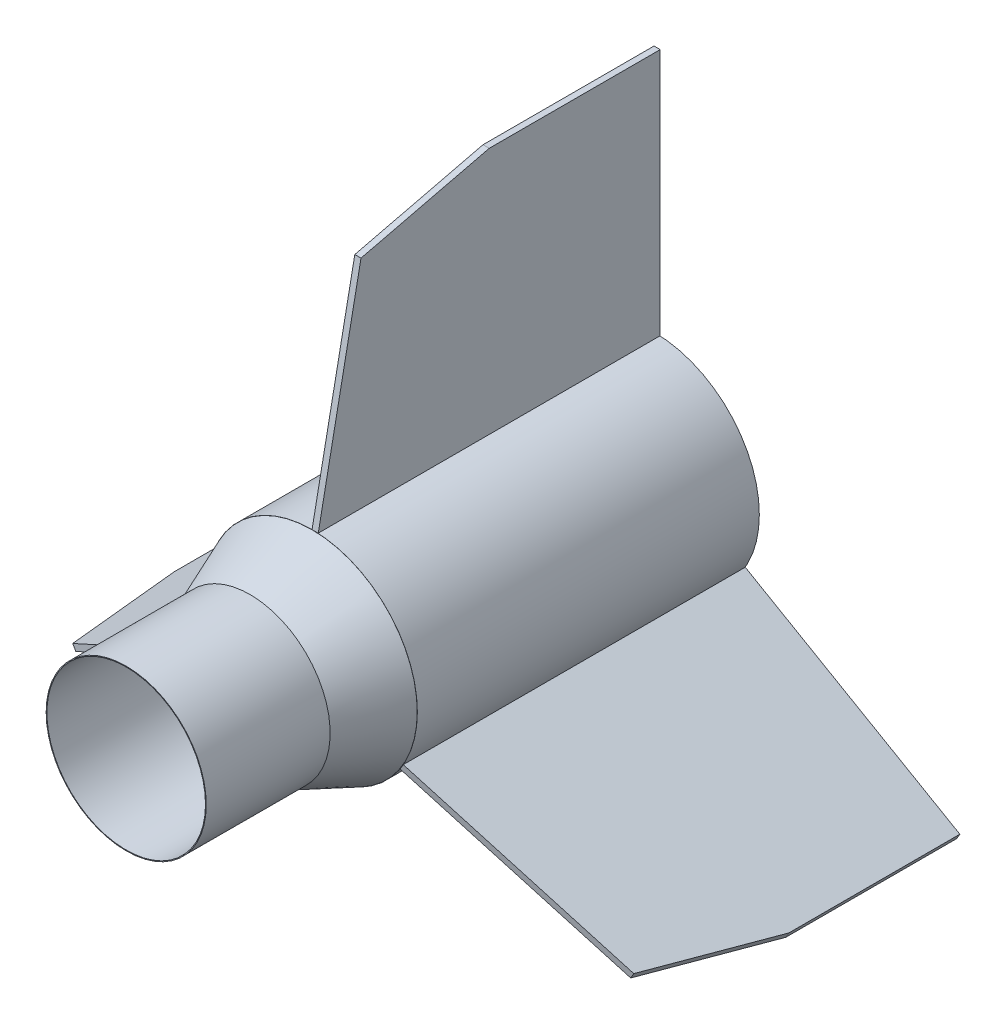
ISO-10303-21;
HEADER;
FILE_DESCRIPTION(('STEP AP214'),'2;1');
FILE_NAME('part.step','',(''),(''),'','','');
FILE_SCHEMA(('AUTOMOTIVE_DESIGN { 1 0 10303 214 1 1 1 1 }'));
ENDSEC;
DATA;
#1=APPLICATION_CONTEXT('core data for automotive mechanical design processes');
#2=APPLICATION_PROTOCOL_DEFINITION('international standard','automotive_design',2000,#1);
#3=PRODUCT_CONTEXT('',#1,'mechanical');
#4=PRODUCT('Part','Part','',(#3));
#5=PRODUCT_RELATED_PRODUCT_CATEGORY('part','',(#4));
#6=PRODUCT_DEFINITION_FORMATION('','',#4);
#7=PRODUCT_DEFINITION_CONTEXT('part definition',#1,'design');
#8=PRODUCT_DEFINITION('design','',#6,#7);
#9=PRODUCT_DEFINITION_SHAPE('','',#8);
#10=(LENGTH_UNIT() NAMED_UNIT(*) SI_UNIT(.MILLI.,.METRE.));
#11=(NAMED_UNIT(*) PLANE_ANGLE_UNIT() SI_UNIT($,.RADIAN.));
#12=(NAMED_UNIT(*) SI_UNIT($,.STERADIAN.) SOLID_ANGLE_UNIT());
#13=UNCERTAINTY_MEASURE_WITH_UNIT(LENGTH_MEASURE(1.E-05),#10,'distance_accuracy_value','');
#14=(GEOMETRIC_REPRESENTATION_CONTEXT(3) GLOBAL_UNCERTAINTY_ASSIGNED_CONTEXT((#13)) GLOBAL_UNIT_ASSIGNED_CONTEXT((#10,
#11,#12)) REPRESENTATION_CONTEXT('',''));
#15=CARTESIAN_POINT('',(0.,0.,0.));
#16=DIRECTION('',(0.,0.,1.));
#17=DIRECTION('',(1.,0.,0.));
#18=AXIS2_PLACEMENT_3D('',#15,#16,#17);
#19=CARTESIAN_POINT('',(18.0624884677061,-11.8948522628061,0.));
#20=DIRECTION('',(0.866025403784443,-0.499999999999992,0.));
#21=DIRECTION('',(0.,0.,1.));
#22=AXIS2_PLACEMENT_3D('',#19,#20,#21);
#23=PLANE('',#22);
#24=DIRECTION('',(0.,0.,-1.));
#25=VECTOR('',#24,1.);
#26=CARTESIAN_POINT('',(18.6974884677061,-10.7949999999998,0.));
#27=LINE('',#26,#25);
#28=CARTESIAN_POINT('',(18.6974884677061,-10.7949999999998,70.1));
#29=VERTEX_POINT('',#28);
#30=CARTESIAN_POINT('',(18.6974884677061,-10.7949999999998,0.));
#31=VERTEX_POINT('',#30);
#32=EDGE_CURVE('E121',#29,#31,#27,.T.);
#33=ORIENTED_EDGE('',*,*,#32,.T.);
#34=DIRECTION('',(0.499999999999992,0.866025403784443,0.));
#35=VECTOR('',#34,1.);
#36=CARTESIAN_POINT('',(18.0624884677061,-11.8948522628061,0.));
#37=LINE('',#36,#35);
#38=CARTESIAN_POINT('',(18.0624884677061,-11.8948522628061,0.));
#39=VERTEX_POINT('',#38);
#40=EDGE_CURVE('E12',#39,#31,#37,.T.);
#41=ORIENTED_EDGE('',*,*,#40,.F.);
#42=DIRECTION('',(0.,0.,-1.));
#43=VECTOR('',#42,1.);
#44=CARTESIAN_POINT('',(18.0624884677061,-11.8948522628061,0.));
#45=LINE('',#44,#43);
#46=CARTESIAN_POINT('',(18.0624884677061,-11.8948522628061,70.1));
#47=VERTEX_POINT('',#46);
#48=EDGE_CURVE('E129',#47,#39,#45,.T.);
#49=ORIENTED_EDGE('',*,*,#48,.F.);
#50=DIRECTION('',(0.499999999999992,0.866025403784443,0.));
#51=VECTOR('',#50,1.);
#52=CARTESIAN_POINT('',(18.0624884677061,-11.8948522628061,70.1));
#53=LINE('',#52,#51);
#54=EDGE_CURVE('E117',#47,#29,#53,.T.);
#55=ORIENTED_EDGE('',*,*,#54,.T.);
#56=EDGE_LOOP('',(#33,#41,#49,#55));
#57=FACE_BOUND('',#56,.T.);
#58=ADVANCED_FACE('F47',(#57),#23,.F.);
#59=CARTESIAN_POINT('',(62.0565789799559,-37.2948522628057,0.));
#60=DIRECTION('',(0.,0.,1.));
#61=DIRECTION('',(-0.499999999999992,-0.866025403784443,0.));
#62=AXIS2_PLACEMENT_3D('',#59,#60,#61);
#63=PLANE('',#62);
#64=DIRECTION('',(0.866025403784443,-0.499999999999992,0.));
#65=VECTOR('',#64,1.);
#66=CARTESIAN_POINT('',(62.6915789799558,-36.1949999999994,0.));
#67=LINE('',#66,#65);
#68=CARTESIAN_POINT('',(62.6915789799558,-36.1949999999994,0.));
#69=VERTEX_POINT('',#68);
#70=EDGE_CURVE('E124',#31,#69,#67,.T.);
#71=ORIENTED_EDGE('',*,*,#70,.T.);
#72=DIRECTION('',(0.499999999999992,0.866025403784443,0.));
#73=VECTOR('',#72,1.);
#74=CARTESIAN_POINT('',(62.0565789799559,-37.2948522628057,0.));
#75=LINE('',#74,#73);
#76=CARTESIAN_POINT('',(62.0565789799559,-37.2948522628057,0.));
#77=VERTEX_POINT('',#76);
#78=EDGE_CURVE('E55',#77,#69,#75,.T.);
#79=ORIENTED_EDGE('',*,*,#78,.F.);
#80=DIRECTION('',(0.866025403784443,-0.499999999999992,0.));
#81=VECTOR('',#80,1.);
#82=CARTESIAN_POINT('',(40.059533723831,-24.5948522628059,0.));
#83=LINE('',#82,#81);
#84=EDGE_CURVE('E97',#39,#77,#83,.T.);
#85=ORIENTED_EDGE('',*,*,#84,.F.);
#86=ORIENTED_EDGE('',*,*,#40,.T.);
#87=EDGE_LOOP('',(#71,#79,#85,#86));
#88=FACE_BOUND('',#87,.T.);
#89=ADVANCED_FACE('F148',(#88),#63,.F.);
#90=CARTESIAN_POINT('',(62.0565789799558,-37.2948522628056,35.05));
#91=DIRECTION('',(-0.866025403784443,0.499999999999992,0.));
#92=DIRECTION('',(0.,0.,-1.));
#93=AXIS2_PLACEMENT_3D('',#90,#91,#92);
#94=PLANE('',#93);
#95=DIRECTION('',(0.,0.,1.));
#96=VECTOR('',#95,1.);
#97=CARTESIAN_POINT('',(62.6915789799558,-36.1949999999994,35.05));
#98=LINE('',#97,#96);
#99=CARTESIAN_POINT('',(62.6915789799558,-36.1949999999994,35.05));
#100=VERTEX_POINT('',#99);
#101=EDGE_CURVE('E112',#69,#100,#98,.T.);
#102=ORIENTED_EDGE('',*,*,#101,.T.);
#103=DIRECTION('',(0.499999999999992,0.866025403784443,0.));
#104=VECTOR('',#103,1.);
#105=CARTESIAN_POINT('',(62.0565789799558,-37.2948522628056,35.05));
#106=LINE('',#105,#104);
#107=CARTESIAN_POINT('',(62.0565789799558,-37.2948522628056,35.05));
#108=VERTEX_POINT('',#107);
#109=EDGE_CURVE('E109',#108,#100,#106,.T.);
#110=ORIENTED_EDGE('',*,*,#109,.F.);
#111=DIRECTION('',(0.,0.,1.));
#112=VECTOR('',#111,1.);
#113=CARTESIAN_POINT('',(62.0565789799558,-37.2948522628056,35.05));
#114=LINE('',#113,#112);
#115=EDGE_CURVE('E101',#77,#108,#114,.T.);
#116=ORIENTED_EDGE('',*,*,#115,.F.);
#117=ORIENTED_EDGE('',*,*,#78,.T.);
#118=EDGE_LOOP('',(#102,#110,#116,#117));
#119=FACE_BOUND('',#118,.T.);
#120=ADVANCED_FACE('F110',(#119),#94,.F.);
#121=CARTESIAN_POINT('',(56.5573176659246,-34.1198522628057,61.3375));
#122=DIRECTION('',(-0.841813242994952,0.486021102450517,-0.234806200708385));
#123=DIRECTION('',(0.20334813477957,-0.117403100354191,-0.972042204901049));
#124=AXIS2_PLACEMENT_3D('',#121,#122,#123);
#125=PLANE('',#124);
#126=DIRECTION('',(-0.20334813477957,0.117403100354191,0.972042204901049));
#127=VECTOR('',#126,1.);
#128=CARTESIAN_POINT('',(57.1923176659246,-33.0199999999995,61.3375));
#129=LINE('',#128,#127);
#130=CARTESIAN_POINT('',(57.1923176659246,-33.0199999999995,61.3375));
#131=VERTEX_POINT('',#130);
#132=EDGE_CURVE('E83',#100,#131,#129,.T.);
#133=ORIENTED_EDGE('',*,*,#132,.T.);
#134=DIRECTION('',(0.499999999999992,0.866025403784443,0.));
#135=VECTOR('',#134,1.);
#136=CARTESIAN_POINT('',(56.5573176659246,-34.1198522628057,61.3375));
#137=LINE('',#136,#135);
#138=CARTESIAN_POINT('',(56.5573176659246,-34.1198522628057,61.3375));
#139=VERTEX_POINT('',#138);
#140=EDGE_CURVE('E113',#139,#131,#137,.T.);
#141=ORIENTED_EDGE('',*,*,#140,.F.);
#142=DIRECTION('',(-0.20334813477957,0.117403100354191,0.972042204901049));
#143=VECTOR('',#142,1.);
#144=CARTESIAN_POINT('',(56.5573176659246,-34.1198522628057,61.3375));
#145=LINE('',#144,#143);
#146=EDGE_CURVE('E105',#108,#139,#145,.T.);
#147=ORIENTED_EDGE('',*,*,#146,.F.);
#148=ORIENTED_EDGE('',*,*,#109,.T.);
#149=EDGE_LOOP('',(#133,#141,#147,#148));
#150=FACE_BOUND('',#149,.T.);
#151=ADVANCED_FACE('F115',(#150),#125,.F.);
#152=CARTESIAN_POINT('',(18.0624884677061,-11.8948522628061,70.1));
#153=DIRECTION('',(-0.167497451271412,0.0967046985801238,-0.981118140230884));
#154=DIRECTION('',(0.849673233553693,-0.490559070115434,-0.193409397160251));
#155=AXIS2_PLACEMENT_3D('',#152,#153,#154);
#156=PLANE('',#155);
#157=DIRECTION('',(-0.849673233553693,0.490559070115434,0.193409397160251));
#158=VECTOR('',#157,1.);
#159=CARTESIAN_POINT('',(18.6974884677061,-10.7949999999998,70.1));
#160=LINE('',#159,#158);
#161=EDGE_CURVE('E89',#131,#29,#160,.T.);
#162=ORIENTED_EDGE('',*,*,#161,.T.);
#163=ORIENTED_EDGE('',*,*,#54,.F.);
#164=DIRECTION('',(-0.849673233553693,0.490559070115434,0.193409397160251));
#165=VECTOR('',#164,1.);
#166=CARTESIAN_POINT('',(18.0624884677061,-11.8948522628061,70.1));
#167=LINE('',#166,#165);
#168=EDGE_CURVE('E63',#139,#47,#167,.T.);
#169=ORIENTED_EDGE('',*,*,#168,.F.);
#170=ORIENTED_EDGE('',*,*,#140,.T.);
#171=EDGE_LOOP('',(#162,#163,#169,#170));
#172=FACE_BOUND('',#171,.T.);
#173=ADVANCED_FACE('F137',(#172),#156,.F.);
#174=CARTESIAN_POINT('',(-0.63499999999999,-1.09985226280624,0.));
#175=DIRECTION('',(-0.499999999999992,-0.866025403784443,0.));
#176=DIRECTION('',(0.,0.,-1.));
#177=AXIS2_PLACEMENT_3D('',#174,#175,#176);
#178=PLANE('',#177);
#179=ORIENTED_EDGE('',*,*,#48,.T.);
#180=ORIENTED_EDGE('',*,*,#84,.T.);
#181=ORIENTED_EDGE('',*,*,#115,.T.);
#182=ORIENTED_EDGE('',*,*,#146,.T.);
#183=ORIENTED_EDGE('',*,*,#168,.T.);
#184=EDGE_LOOP('',(#179,#180,#181,#182,#183));
#185=FACE_BOUND('',#184,.T.);
#186=ADVANCED_FACE('F103',(#185),#178,.T.);
#187=CARTESIAN_POINT('',(0.,0.,0.));
#188=DIRECTION('',(-0.499999999999992,-0.866025403784443,0.));
#189=DIRECTION('',(0.,0.,-1.));
#190=AXIS2_PLACEMENT_3D('',#187,#188,#189);
#191=PLANE('',#190);
#192=ORIENTED_EDGE('',*,*,#32,.F.);
#193=ORIENTED_EDGE('',*,*,#161,.F.);
#194=ORIENTED_EDGE('',*,*,#132,.F.);
#195=ORIENTED_EDGE('',*,*,#101,.F.);
#196=ORIENTED_EDGE('',*,*,#70,.F.);
#197=EDGE_LOOP('',(#192,#193,#194,#195,#196));
#198=FACE_BOUND('',#197,.T.);
#199=ADVANCED_FACE('F133',(#198),#191,.F.);
#200=CLOSED_SHELL('',(#58,#89,#120,#151,#173,#186,#199));
#201=MANIFOLD_SOLID_BREP('B2',#200);
#202=CARTESIAN_POINT('',(-19.332488467706,-9.69514773719385,0.));
#203=DIRECTION('',(-0.866025403784436,-0.500000000000004,0.));
#204=DIRECTION('',(0.,0.,1.));
#205=AXIS2_PLACEMENT_3D('',#202,#203,#204);
#206=PLANE('',#205);
#207=DIRECTION('',(0.,0.,-1.));
#208=VECTOR('',#207,1.);
#209=CARTESIAN_POINT('',(-18.697488467706,-10.7950000000001,0.));
#210=LINE('',#209,#208);
#211=CARTESIAN_POINT('',(-18.697488467706,-10.7950000000001,70.1));
#212=VERTEX_POINT('',#211);
#213=CARTESIAN_POINT('',(-18.697488467706,-10.7950000000001,0.));
#214=VERTEX_POINT('',#213);
#215=EDGE_CURVE('E283',#212,#214,#210,.T.);
#216=ORIENTED_EDGE('',*,*,#215,.T.);
#217=DIRECTION('',(0.500000000000004,-0.866025403784436,0.));
#218=VECTOR('',#217,1.);
#219=CARTESIAN_POINT('',(-19.332488467706,-9.69514773719385,0.));
#220=LINE('',#219,#218);
#221=CARTESIAN_POINT('',(-19.332488467706,-9.69514773719385,0.));
#222=VERTEX_POINT('',#221);
#223=EDGE_CURVE('E45',#222,#214,#220,.T.);
#224=ORIENTED_EDGE('',*,*,#223,.F.);
#225=DIRECTION('',(0.,0.,-1.));
#226=VECTOR('',#225,1.);
#227=CARTESIAN_POINT('',(-19.332488467706,-9.69514773719385,0.));
#228=LINE('',#227,#226);
#229=CARTESIAN_POINT('',(-19.332488467706,-9.69514773719385,70.1));
#230=VERTEX_POINT('',#229);
#231=EDGE_CURVE('E291',#230,#222,#228,.T.);
#232=ORIENTED_EDGE('',*,*,#231,.F.);
#233=DIRECTION('',(0.500000000000004,-0.866025403784436,0.));
#234=VECTOR('',#233,1.);
#235=CARTESIAN_POINT('',(-19.332488467706,-9.69514773719385,70.1));
#236=LINE('',#235,#234);
#237=EDGE_CURVE('E279',#230,#212,#236,.T.);
#238=ORIENTED_EDGE('',*,*,#237,.T.);
#239=EDGE_LOOP('',(#216,#224,#232,#238));
#240=FACE_BOUND('',#239,.T.);
#241=ADVANCED_FACE('F209',(#240),#206,.F.);
#242=CARTESIAN_POINT('',(-63.3265789799554,-35.0951477371941,0.));
#243=DIRECTION('',(0.,0.,1.));
#244=DIRECTION('',(-0.500000000000004,0.866025403784436,0.));
#245=AXIS2_PLACEMENT_3D('',#242,#243,#244);
#246=PLANE('',#245);
#247=DIRECTION('',(-0.866025403784436,-0.500000000000004,0.));
#248=VECTOR('',#247,1.);
#249=CARTESIAN_POINT('',(-62.6915789799554,-36.1950000000003,0.));
#250=LINE('',#249,#248);
#251=CARTESIAN_POINT('',(-62.6915789799554,-36.1950000000003,0.));
#252=VERTEX_POINT('',#251);
#253=EDGE_CURVE('E286',#214,#252,#250,.T.);
#254=ORIENTED_EDGE('',*,*,#253,.T.);
#255=DIRECTION('',(0.500000000000004,-0.866025403784436,0.));
#256=VECTOR('',#255,1.);
#257=CARTESIAN_POINT('',(-63.3265789799554,-35.0951477371941,0.));
#258=LINE('',#257,#256);
#259=CARTESIAN_POINT('',(-63.3265789799554,-35.0951477371941,0.));
#260=VERTEX_POINT('',#259);
#261=EDGE_CURVE('E217',#260,#252,#258,.T.);
#262=ORIENTED_EDGE('',*,*,#261,.F.);
#263=DIRECTION('',(-0.866025403784436,-0.500000000000004,0.));
#264=VECTOR('',#263,1.);
#265=CARTESIAN_POINT('',(-41.3295337238307,-22.395147737194,0.));
#266=LINE('',#265,#264);
#267=EDGE_CURVE('E259',#222,#260,#266,.T.);
#268=ORIENTED_EDGE('',*,*,#267,.F.);
#269=ORIENTED_EDGE('',*,*,#223,.T.);
#270=EDGE_LOOP('',(#254,#262,#268,#269));
#271=FACE_BOUND('',#270,.T.);
#272=ADVANCED_FACE('F310',(#271),#246,.F.);
#273=CARTESIAN_POINT('',(-63.3265789799554,-35.0951477371941,35.05));
#274=DIRECTION('',(0.866025403784436,0.500000000000004,0.));
#275=DIRECTION('',(0.,0.,-1.));
#276=AXIS2_PLACEMENT_3D('',#273,#274,#275);
#277=PLANE('',#276);
#278=DIRECTION('',(0.,0.,1.));
#279=VECTOR('',#278,1.);
#280=CARTESIAN_POINT('',(-62.6915789799553,-36.1950000000003,35.05));
#281=LINE('',#280,#279);
#282=CARTESIAN_POINT('',(-62.6915789799553,-36.1950000000003,35.05));
#283=VERTEX_POINT('',#282);
#284=EDGE_CURVE('E274',#252,#283,#281,.T.);
#285=ORIENTED_EDGE('',*,*,#284,.T.);
#286=DIRECTION('',(0.500000000000004,-0.866025403784436,0.));
#287=VECTOR('',#286,1.);
#288=CARTESIAN_POINT('',(-63.3265789799554,-35.0951477371941,35.05));
#289=LINE('',#288,#287);
#290=CARTESIAN_POINT('',(-63.3265789799554,-35.0951477371941,35.05));
#291=VERTEX_POINT('',#290);
#292=EDGE_CURVE('E271',#291,#283,#289,.T.);
#293=ORIENTED_EDGE('',*,*,#292,.F.);
#294=DIRECTION('',(0.,0.,1.));
#295=VECTOR('',#294,1.);
#296=CARTESIAN_POINT('',(-63.3265789799554,-35.0951477371941,35.05));
#297=LINE('',#296,#295);
#298=EDGE_CURVE('E263',#260,#291,#297,.T.);
#299=ORIENTED_EDGE('',*,*,#298,.F.);
#300=ORIENTED_EDGE('',*,*,#261,.T.);
#301=EDGE_LOOP('',(#285,#293,#299,#300));
#302=FACE_BOUND('',#301,.T.);
#303=ADVANCED_FACE('F272',(#302),#277,.F.);
#304=CARTESIAN_POINT('',(-57.8273176659242,-31.920147737194,61.3375));
#305=DIRECTION('',(0.841813242994945,0.486021102450529,-0.234806200708385));
#306=DIRECTION('',(-0.203348134779569,-0.117403100354194,-0.972042204901049));
#307=AXIS2_PLACEMENT_3D('',#304,#305,#306);
#308=PLANE('',#307);
#309=DIRECTION('',(0.203348134779569,0.117403100354194,0.972042204901049));
#310=VECTOR('',#309,1.);
#311=CARTESIAN_POINT('',(-57.1923176659242,-33.0200000000003,61.3375));
#312=LINE('',#311,#310);
#313=CARTESIAN_POINT('',(-57.1923176659242,-33.0200000000003,61.3375));
#314=VERTEX_POINT('',#313);
#315=EDGE_CURVE('E245',#283,#314,#312,.T.);
#316=ORIENTED_EDGE('',*,*,#315,.T.);
#317=DIRECTION('',(0.500000000000004,-0.866025403784436,0.));
#318=VECTOR('',#317,1.);
#319=CARTESIAN_POINT('',(-57.8273176659242,-31.920147737194,61.3375));
#320=LINE('',#319,#318);
#321=CARTESIAN_POINT('',(-57.8273176659242,-31.920147737194,61.3375));
#322=VERTEX_POINT('',#321);
#323=EDGE_CURVE('E275',#322,#314,#320,.T.);
#324=ORIENTED_EDGE('',*,*,#323,.F.);
#325=DIRECTION('',(0.203348134779569,0.117403100354194,0.972042204901049));
#326=VECTOR('',#325,1.);
#327=CARTESIAN_POINT('',(-57.8273176659242,-31.920147737194,61.3375));
#328=LINE('',#327,#326);
#329=EDGE_CURVE('E267',#291,#322,#328,.T.);
#330=ORIENTED_EDGE('',*,*,#329,.F.);
#331=ORIENTED_EDGE('',*,*,#292,.T.);
#332=EDGE_LOOP('',(#316,#324,#330,#331));
#333=FACE_BOUND('',#332,.T.);
#334=ADVANCED_FACE('F277',(#333),#308,.F.);
#335=CARTESIAN_POINT('',(-19.332488467706,-9.69514773719385,70.1));
#336=DIRECTION('',(0.16749745127141,0.0967046985801261,-0.981118140230884));
#337=DIRECTION('',(-0.849673233553687,-0.490559070115446,-0.193409397160251));
#338=AXIS2_PLACEMENT_3D('',#335,#336,#337);
#339=PLANE('',#338);
#340=DIRECTION('',(0.849673233553687,0.490559070115446,0.193409397160251));
#341=VECTOR('',#340,1.);
#342=CARTESIAN_POINT('',(-18.697488467706,-10.7950000000001,70.1));
#343=LINE('',#342,#341);
#344=EDGE_CURVE('E251',#314,#212,#343,.T.);
#345=ORIENTED_EDGE('',*,*,#344,.T.);
#346=ORIENTED_EDGE('',*,*,#237,.F.);
#347=DIRECTION('',(0.849673233553687,0.490559070115446,0.193409397160251));
#348=VECTOR('',#347,1.);
#349=CARTESIAN_POINT('',(-19.332488467706,-9.69514773719385,70.1));
#350=LINE('',#349,#348);
#351=EDGE_CURVE('E225',#322,#230,#350,.T.);
#352=ORIENTED_EDGE('',*,*,#351,.F.);
#353=ORIENTED_EDGE('',*,*,#323,.T.);
#354=EDGE_LOOP('',(#345,#346,#352,#353));
#355=FACE_BOUND('',#354,.T.);
#356=ADVANCED_FACE('F299',(#355),#339,.F.);
#357=CARTESIAN_POINT('',(-0.635000000000005,1.09985226280623,0.));
#358=DIRECTION('',(-0.500000000000004,0.866025403784436,0.));
#359=DIRECTION('',(0.,0.,-1.));
#360=AXIS2_PLACEMENT_3D('',#357,#358,#359);
#361=PLANE('',#360);
#362=ORIENTED_EDGE('',*,*,#231,.T.);
#363=ORIENTED_EDGE('',*,*,#267,.T.);
#364=ORIENTED_EDGE('',*,*,#298,.T.);
#365=ORIENTED_EDGE('',*,*,#329,.T.);
#366=ORIENTED_EDGE('',*,*,#351,.T.);
#367=EDGE_LOOP('',(#362,#363,#364,#365,#366));
#368=FACE_BOUND('',#367,.T.);
#369=ADVANCED_FACE('F265',(#368),#361,.T.);
#370=CARTESIAN_POINT('',(0.,0.,0.));
#371=DIRECTION('',(-0.500000000000004,0.866025403784436,0.));
#372=DIRECTION('',(0.,0.,-1.));
#373=AXIS2_PLACEMENT_3D('',#370,#371,#372);
#374=PLANE('',#373);
#375=ORIENTED_EDGE('',*,*,#215,.F.);
#376=ORIENTED_EDGE('',*,*,#344,.F.);
#377=ORIENTED_EDGE('',*,*,#315,.F.);
#378=ORIENTED_EDGE('',*,*,#284,.F.);
#379=ORIENTED_EDGE('',*,*,#253,.F.);
#380=EDGE_LOOP('',(#375,#376,#377,#378,#379));
#381=FACE_BOUND('',#380,.T.);
#382=ADVANCED_FACE('F295',(#381),#374,.F.);
#383=CLOSED_SHELL('',(#241,#272,#303,#334,#356,#369,#382));
#384=MANIFOLD_SOLID_BREP('B6',#383);
#385=CARTESIAN_POINT('',(1.27,21.59,0.));
#386=DIRECTION('',(0.,1.,0.));
#387=DIRECTION('',(0.,0.,1.));
#388=AXIS2_PLACEMENT_3D('',#385,#386,#387);
#389=PLANE('',#388);
#390=DIRECTION('',(0.,0.,-1.));
#391=VECTOR('',#390,1.);
#392=CARTESIAN_POINT('',(0.,21.59,0.));
#393=LINE('',#392,#391);
#394=CARTESIAN_POINT('',(0.,21.59,70.1));
#395=VERTEX_POINT('',#394);
#396=CARTESIAN_POINT('',(0.,21.59,0.));
#397=VERTEX_POINT('',#396);
#398=EDGE_CURVE('E444',#395,#397,#393,.T.);
#399=ORIENTED_EDGE('',*,*,#398,.T.);
#400=DIRECTION('',(-1.,0.,0.));
#401=VECTOR('',#400,1.);
#402=CARTESIAN_POINT('',(1.27,21.59,0.));
#403=LINE('',#402,#401);
#404=CARTESIAN_POINT('',(1.27,21.59,0.));
#405=VERTEX_POINT('',#404);
#406=EDGE_CURVE('E207',#405,#397,#403,.T.);
#407=ORIENTED_EDGE('',*,*,#406,.F.);
#408=DIRECTION('',(0.,0.,-1.));
#409=VECTOR('',#408,1.);
#410=CARTESIAN_POINT('',(1.27,21.59,0.));
#411=LINE('',#410,#409);
#412=CARTESIAN_POINT('',(1.27,21.59,70.1));
#413=VERTEX_POINT('',#412);
#414=EDGE_CURVE('E452',#413,#405,#411,.T.);
#415=ORIENTED_EDGE('',*,*,#414,.F.);
#416=DIRECTION('',(-1.,0.,0.));
#417=VECTOR('',#416,1.);
#418=CARTESIAN_POINT('',(1.27,21.59,70.1));
#419=LINE('',#418,#417);
#420=EDGE_CURVE('E440',#413,#395,#419,.T.);
#421=ORIENTED_EDGE('',*,*,#420,.T.);
#422=EDGE_LOOP('',(#399,#407,#415,#421));
#423=FACE_BOUND('',#422,.T.);
#424=ADVANCED_FACE('F370',(#423),#389,.F.);
#425=CARTESIAN_POINT('',(1.27,72.39,0.));
#426=DIRECTION('',(0.,0.,1.));
#427=DIRECTION('',(1.,0.,0.));
#428=AXIS2_PLACEMENT_3D('',#425,#426,#427);
#429=PLANE('',#428);
#430=DIRECTION('',(0.,1.,0.));
#431=VECTOR('',#430,1.);
#432=CARTESIAN_POINT('',(0.,72.39,0.));
#433=LINE('',#432,#431);
#434=CARTESIAN_POINT('',(0.,72.39,0.));
#435=VERTEX_POINT('',#434);
#436=EDGE_CURVE('E447',#397,#435,#433,.T.);
#437=ORIENTED_EDGE('',*,*,#436,.T.);
#438=DIRECTION('',(-1.,0.,0.));
#439=VECTOR('',#438,1.);
#440=CARTESIAN_POINT('',(1.27,72.39,0.));
#441=LINE('',#440,#439);
#442=CARTESIAN_POINT('',(1.27,72.39,0.));
#443=VERTEX_POINT('',#442);
#444=EDGE_CURVE('E378',#443,#435,#441,.T.);
#445=ORIENTED_EDGE('',*,*,#444,.F.);
#446=DIRECTION('',(0.,1.,0.));
#447=VECTOR('',#446,1.);
#448=CARTESIAN_POINT('',(1.27,46.99,0.));
#449=LINE('',#448,#447);
#450=EDGE_CURVE('E420',#405,#443,#449,.T.);
#451=ORIENTED_EDGE('',*,*,#450,.F.);
#452=ORIENTED_EDGE('',*,*,#406,.T.);
#453=EDGE_LOOP('',(#437,#445,#451,#452));
#454=FACE_BOUND('',#453,.T.);
#455=ADVANCED_FACE('F471',(#454),#429,.F.);
#456=CARTESIAN_POINT('',(1.27,72.39,35.05));
#457=DIRECTION('',(0.,-1.,0.));
#458=DIRECTION('',(0.,0.,-1.));
#459=AXIS2_PLACEMENT_3D('',#456,#457,#458);
#460=PLANE('',#459);
#461=DIRECTION('',(0.,0.,1.));
#462=VECTOR('',#461,1.);
#463=CARTESIAN_POINT('',(0.,72.39,35.05));
#464=LINE('',#463,#462);
#465=CARTESIAN_POINT('',(0.,72.39,35.05));
#466=VERTEX_POINT('',#465);
#467=EDGE_CURVE('E435',#435,#466,#464,.T.);
#468=ORIENTED_EDGE('',*,*,#467,.T.);
#469=DIRECTION('',(-1.,0.,0.));
#470=VECTOR('',#469,1.);
#471=CARTESIAN_POINT('',(1.27,72.39,35.05));
#472=LINE('',#471,#470);
#473=CARTESIAN_POINT('',(1.27,72.39,35.05));
#474=VERTEX_POINT('',#473);
#475=EDGE_CURVE('E432',#474,#466,#472,.T.);
#476=ORIENTED_EDGE('',*,*,#475,.F.);
#477=DIRECTION('',(0.,0.,1.));
#478=VECTOR('',#477,1.);
#479=CARTESIAN_POINT('',(1.27,72.39,35.05));
#480=LINE('',#479,#478);
#481=EDGE_CURVE('E424',#443,#474,#480,.T.);
#482=ORIENTED_EDGE('',*,*,#481,.F.);
#483=ORIENTED_EDGE('',*,*,#444,.T.);
#484=EDGE_LOOP('',(#468,#476,#482,#483));
#485=FACE_BOUND('',#484,.T.);
#486=ADVANCED_FACE('F433',(#485),#460,.F.);
#487=CARTESIAN_POINT('',(1.27,66.04,61.3375));
#488=DIRECTION('',(0.,-0.972042204901049,-0.234806200708385));
#489=DIRECTION('',(0.,0.234806200708385,-0.972042204901049));
#490=AXIS2_PLACEMENT_3D('',#487,#488,#489);
#491=PLANE('',#490);
#492=DIRECTION('',(0.,-0.234806200708385,0.972042204901049));
#493=VECTOR('',#492,1.);
#494=CARTESIAN_POINT('',(0.,66.04,61.3375));
#495=LINE('',#494,#493);
#496=CARTESIAN_POINT('',(0.,66.04,61.3375));
#497=VERTEX_POINT('',#496);
#498=EDGE_CURVE('E406',#466,#497,#495,.T.);
#499=ORIENTED_EDGE('',*,*,#498,.T.);
#500=DIRECTION('',(-1.,0.,0.));
#501=VECTOR('',#500,1.);
#502=CARTESIAN_POINT('',(1.27,66.04,61.3375));
#503=LINE('',#502,#501);
#504=CARTESIAN_POINT('',(1.27,66.04,61.3375));
#505=VERTEX_POINT('',#504);
#506=EDGE_CURVE('E436',#505,#497,#503,.T.);
#507=ORIENTED_EDGE('',*,*,#506,.F.);
#508=DIRECTION('',(0.,-0.234806200708385,0.972042204901049));
#509=VECTOR('',#508,1.);
#510=CARTESIAN_POINT('',(1.27,66.04,61.3375));
#511=LINE('',#510,#509);
#512=EDGE_CURVE('E428',#474,#505,#511,.T.);
#513=ORIENTED_EDGE('',*,*,#512,.F.);
#514=ORIENTED_EDGE('',*,*,#475,.T.);
#515=EDGE_LOOP('',(#499,#507,#513,#514));
#516=FACE_BOUND('',#515,.T.);
#517=ADVANCED_FACE('F438',(#516),#491,.F.);
#518=CARTESIAN_POINT('',(1.27,21.59,70.1));
#519=DIRECTION('',(0.,-0.193409397160251,-0.981118140230884));
#520=DIRECTION('',(0.,0.981118140230884,-0.193409397160251));
#521=AXIS2_PLACEMENT_3D('',#518,#519,#520);
#522=PLANE('',#521);
#523=DIRECTION('',(0.,-0.981118140230884,0.193409397160251));
#524=VECTOR('',#523,1.);
#525=CARTESIAN_POINT('',(0.,21.59,70.1));
#526=LINE('',#525,#524);
#527=EDGE_CURVE('E412',#497,#395,#526,.T.);
#528=ORIENTED_EDGE('',*,*,#527,.T.);
#529=ORIENTED_EDGE('',*,*,#420,.F.);
#530=DIRECTION('',(0.,-0.981118140230884,0.193409397160251));
#531=VECTOR('',#530,1.);
#532=CARTESIAN_POINT('',(1.27,21.59,70.1));
#533=LINE('',#532,#531);
#534=EDGE_CURVE('E386',#505,#413,#533,.T.);
#535=ORIENTED_EDGE('',*,*,#534,.F.);
#536=ORIENTED_EDGE('',*,*,#506,.T.);
#537=EDGE_LOOP('',(#528,#529,#535,#536));
#538=FACE_BOUND('',#537,.T.);
#539=ADVANCED_FACE('F460',(#538),#522,.F.);
#540=CARTESIAN_POINT('',(1.27,0.,0.));
#541=DIRECTION('',(1.,0.,0.));
#542=DIRECTION('',(0.,0.,-1.));
#543=AXIS2_PLACEMENT_3D('',#540,#541,#542);
#544=PLANE('',#543);
#545=ORIENTED_EDGE('',*,*,#414,.T.);
#546=ORIENTED_EDGE('',*,*,#450,.T.);
#547=ORIENTED_EDGE('',*,*,#481,.T.);
#548=ORIENTED_EDGE('',*,*,#512,.T.);
#549=ORIENTED_EDGE('',*,*,#534,.T.);
#550=EDGE_LOOP('',(#545,#546,#547,#548,#549));
#551=FACE_BOUND('',#550,.T.);
#552=ADVANCED_FACE('F426',(#551),#544,.T.);
#553=CARTESIAN_POINT('',(0.,0.,0.));
#554=DIRECTION('',(1.,0.,0.));
#555=DIRECTION('',(0.,0.,-1.));
#556=AXIS2_PLACEMENT_3D('',#553,#554,#555);
#557=PLANE('',#556);
#558=ORIENTED_EDGE('',*,*,#398,.F.);
#559=ORIENTED_EDGE('',*,*,#527,.F.);
#560=ORIENTED_EDGE('',*,*,#498,.F.);
#561=ORIENTED_EDGE('',*,*,#467,.F.);
#562=ORIENTED_EDGE('',*,*,#436,.F.);
#563=EDGE_LOOP('',(#558,#559,#560,#561,#562));
#564=FACE_BOUND('',#563,.T.);
#565=ADVANCED_FACE('F456',(#564),#557,.F.);
#566=CLOSED_SHELL('',(#424,#455,#486,#517,#539,#552,#565));
#567=MANIFOLD_SOLID_BREP('B39',#566);
#568=CARTESIAN_POINT('',(0.,0.,108.2));
#569=DIRECTION('',(0.,0.,-1.));
#570=DIRECTION('',(-1.,0.,0.));
#571=AXIS2_PLACEMENT_3D('',#568,#569,#570);
#572=CYLINDRICAL_SURFACE('',#571,16.4084);
#573=CARTESIAN_POINT('',(0.,0.,108.2));
#574=DIRECTION('',(0.,0.,1.));
#575=DIRECTION('',(1.,0.,0.));
#576=AXIS2_PLACEMENT_3D('',#573,#574,#575);
#577=CIRCLE('',#576,16.4084);
#578=CARTESIAN_POINT('',(16.4084,0.,108.2));
#579=VERTEX_POINT('',#578);
#580=EDGE_CURVE('E585',#579,#579,#577,.T.);
#581=ORIENTED_EDGE('',*,*,#580,.F.);
#582=EDGE_LOOP('',(#581));
#583=FACE_BOUND('',#582,.T.);
#584=CARTESIAN_POINT('',(0.,0.,82.8));
#585=DIRECTION('',(0.,0.,-1.));
#586=DIRECTION('',(-1.,0.,0.));
#587=AXIS2_PLACEMENT_3D('',#584,#585,#586);
#588=CIRCLE('',#587,16.4084);
#589=CARTESIAN_POINT('',(-16.4084,0.,82.8));
#590=VERTEX_POINT('',#589);
#591=EDGE_CURVE('E368',#590,#590,#588,.T.);
#592=ORIENTED_EDGE('',*,*,#591,.F.);
#593=EDGE_LOOP('',(#592));
#594=FACE_BOUND('',#593,.T.);
#595=ADVANCED_FACE('F522',(#583,#594),#572,.T.);
#596=CARTESIAN_POINT('',(0.,0.,70.1));
#597=DIRECTION('',(0.,0.,1.));
#598=DIRECTION('',(1.,0.,0.));
#599=AXIS2_PLACEMENT_3D('',#596,#597,#598);
#600=PLANE('',#599);
#601=CARTESIAN_POINT('',(9.95557947936446,5.86947069419869,70.1));
#602=DIRECTION('',(0.,0.,1.));
#603=DIRECTION('',(1.,0.,0.));
#604=AXIS2_PLACEMENT_3D('',#601,#602,#603);
#605=CIRCLE('',#604,9.144);
#606=CARTESIAN_POINT('',(7.18292591962797,14.5829733330736,70.1));
#607=VERTEX_POINT('',#606);
#608=CARTESIAN_POINT('',(16.2375116890544,-0.775080736323875,70.1));
#609=VERTEX_POINT('',#608);
#610=EDGE_CURVE('E556',#607,#609,#605,.T.);
#611=ORIENTED_EDGE('',*,*,#610,.F.);
#612=CARTESIAN_POINT('',(0.,0.,70.1));
#613=DIRECTION('',(0.,0.,1.));
#614=DIRECTION('',(1.,0.,0.));
#615=AXIS2_PLACEMENT_3D('',#612,#613,#614);
#616=CIRCLE('',#615,16.256);
#617=CARTESIAN_POINT('',(-7.44751623688686,14.4496379851298,70.1));
#618=VERTEX_POINT('',#617);
#619=EDGE_CURVE('E543',#607,#618,#616,.T.);
#620=ORIENTED_EDGE('',*,*,#619,.T.);
#621=CARTESIAN_POINT('',(-10.0609004676266,5.68704939142529,70.1));
#622=DIRECTION('',(0.,0.,1.));
#623=DIRECTION('',(1.,0.,0.));
#624=AXIS2_PLACEMENT_3D('',#621,#622,#623);
#625=CIRCLE('',#624,9.144);
#626=CARTESIAN_POINT('',(-16.2206883289668,-1.07089034663737,70.1));
#627=VERTEX_POINT('',#626);
#628=EDGE_CURVE('E606',#627,#618,#625,.T.);
#629=ORIENTED_EDGE('',*,*,#628,.F.);
#630=CARTESIAN_POINT('',(-8.77414726783974,-13.6847314815549,70.1));
#631=VERTEX_POINT('',#630);
#632=EDGE_CURVE('E530',#627,#631,#616,.T.);
#633=ORIENTED_EDGE('',*,*,#632,.T.);
#634=CARTESIAN_POINT('',(0.118855303980422,-11.557,70.1));
#635=DIRECTION('',(0.,0.,1.));
#636=DIRECTION('',(1.,0.,0.));
#637=AXIS2_PLACEMENT_3D('',#634,#635,#636);
#638=CIRCLE('',#637,9.144);
#639=CARTESIAN_POINT('',(9.05373661670377,-13.5013847169599,70.1));
#640=VERTEX_POINT('',#639);
#641=EDGE_CURVE('E600',#640,#631,#638,.T.);
#642=ORIENTED_EDGE('',*,*,#641,.F.);
#643=EDGE_CURVE('E561',#640,#609,#616,.T.);
#644=ORIENTED_EDGE('',*,*,#643,.T.);
#645=EDGE_LOOP('',(#611,#620,#629,#633,#642,#644));
#646=FACE_BOUND('',#645,.T.);
#647=ADVANCED_FACE('F558',(#646),#600,.T.);
#648=CARTESIAN_POINT('',(0.,0.,70.1));
#649=DIRECTION('',(0.,0.,1.));
#650=DIRECTION('',(1.,0.,0.));
#651=AXIS2_PLACEMENT_3D('',#648,#649,#650);
#652=CIRCLE('',#651,21.5623465399517);
#653=CARTESIAN_POINT('',(21.5623465399517,0.,70.1));
#654=VERTEX_POINT('',#653);
#655=EDGE_CURVE('E576',#654,#654,#652,.T.);
#656=ORIENTED_EDGE('',*,*,#655,.F.);
#657=EDGE_LOOP('',(#656));
#658=FACE_BOUND('',#657,.T.);
#659=CARTESIAN_POINT('',(0.,0.,70.1));
#660=DIRECTION('',(0.,0.,1.));
#661=DIRECTION('',(1.,0.,0.));
#662=AXIS2_PLACEMENT_3D('',#659,#660,#661);
#663=CIRCLE('',#662,21.59);
#664=CARTESIAN_POINT('',(21.59,0.,70.1));
#665=VERTEX_POINT('',#664);
#666=EDGE_CURVE('E589',#665,#665,#663,.T.);
#667=ORIENTED_EDGE('',*,*,#666,.T.);
#668=EDGE_LOOP('',(#667));
#669=FACE_BOUND('',#668,.T.);
#670=ADVANCED_FACE('F633',(#658,#669),#600,.T.);
#671=CARTESIAN_POINT('',(0.,0.,0.));
#672=DIRECTION('',(0.,0.,1.));
#673=DIRECTION('',(1.,0.,0.));
#674=AXIS2_PLACEMENT_3D('',#671,#672,#673);
#675=PLANE('',#674);
#676=CARTESIAN_POINT('',(0.,0.,0.));
#677=DIRECTION('',(0.,0.,1.));
#678=DIRECTION('',(1.,0.,0.));
#679=AXIS2_PLACEMENT_3D('',#676,#677,#678);
#680=CIRCLE('',#679,21.59);
#681=CARTESIAN_POINT('',(21.59,0.,0.));
#682=VERTEX_POINT('',#681);
#683=EDGE_CURVE('E591',#682,#682,#680,.T.);
#684=ORIENTED_EDGE('',*,*,#683,.F.);
#685=EDGE_LOOP('',(#684));
#686=FACE_BOUND('',#685,.T.);
#687=CARTESIAN_POINT('',(0.118855303980422,-11.557,0.));
#688=DIRECTION('',(0.,0.,1.));
#689=DIRECTION('',(1.,0.,0.));
#690=AXIS2_PLACEMENT_3D('',#687,#688,#689);
#691=CIRCLE('',#690,9.144);
#692=CARTESIAN_POINT('',(9.26285530398042,-11.557,0.));
#693=VERTEX_POINT('',#692);
#694=EDGE_CURVE('E571',#693,#693,#691,.T.);
#695=ORIENTED_EDGE('',*,*,#694,.T.);
#696=EDGE_LOOP('',(#695));
#697=FACE_BOUND('',#696,.T.);
#698=CARTESIAN_POINT('',(9.95557947936446,5.86947069419869,0.));
#699=DIRECTION('',(0.,0.,1.));
#700=DIRECTION('',(1.,0.,0.));
#701=AXIS2_PLACEMENT_3D('',#698,#699,#700);
#702=CIRCLE('',#701,9.144);
#703=CARTESIAN_POINT('',(19.0995794793645,5.86947069419869,0.));
#704=VERTEX_POINT('',#703);
#705=EDGE_CURVE('E565',#704,#704,#702,.T.);
#706=ORIENTED_EDGE('',*,*,#705,.T.);
#707=EDGE_LOOP('',(#706));
#708=FACE_BOUND('',#707,.T.);
#709=CARTESIAN_POINT('',(-10.0609004676266,5.68704939142529,0.));
#710=DIRECTION('',(0.,0.,1.));
#711=DIRECTION('',(1.,0.,0.));
#712=AXIS2_PLACEMENT_3D('',#709,#710,#711);
#713=CIRCLE('',#712,9.144);
#714=CARTESIAN_POINT('',(-0.916900467626609,5.68704939142529,0.));
#715=VERTEX_POINT('',#714);
#716=EDGE_CURVE('E604',#715,#715,#713,.T.);
#717=ORIENTED_EDGE('',*,*,#716,.T.);
#718=EDGE_LOOP('',(#717));
#719=FACE_BOUND('',#718,.T.);
#720=ADVANCED_FACE('F649',(#686,#697,#708,#719),#675,.F.);
#721=CARTESIAN_POINT('',(0.,0.,70.1));
#722=DIRECTION('',(0.,0.,-1.));
#723=DIRECTION('',(-1.,0.,0.));
#724=AXIS2_PLACEMENT_3D('',#721,#722,#723);
#725=CYLINDRICAL_SURFACE('',#724,21.59);
#726=ORIENTED_EDGE('',*,*,#666,.F.);
#727=EDGE_LOOP('',(#726));
#728=FACE_BOUND('',#727,.T.);
#729=ORIENTED_EDGE('',*,*,#683,.T.);
#730=EDGE_LOOP('',(#729));
#731=FACE_BOUND('',#730,.T.);
#732=ADVANCED_FACE('F524',(#728,#731),#725,.T.);
#733=CARTESIAN_POINT('',(0.118855303980422,-11.557,70.1));
#734=DIRECTION('',(0.,0.,-1.));
#735=DIRECTION('',(-1.,0.,0.));
#736=AXIS2_PLACEMENT_3D('',#733,#734,#735);
#737=CYLINDRICAL_SURFACE('',#736,9.144);
#738=EDGE_CURVE('E596',#631,#640,#638,.T.);
#739=ORIENTED_EDGE('',*,*,#738,.T.);
#740=ORIENTED_EDGE('',*,*,#641,.T.);
#741=EDGE_LOOP('',(#739,#740));
#742=FACE_BOUND('',#741,.T.);
#743=ORIENTED_EDGE('',*,*,#694,.F.);
#744=EDGE_LOOP('',(#743));
#745=FACE_BOUND('',#744,.T.);
#746=ADVANCED_FACE('F645',(#742,#745),#737,.F.);
#747=CARTESIAN_POINT('',(9.95557947936446,5.86947069419869,70.1));
#748=DIRECTION('',(0.,0.,-1.));
#749=DIRECTION('',(-1.,0.,0.));
#750=AXIS2_PLACEMENT_3D('',#747,#748,#749);
#751=CYLINDRICAL_SURFACE('',#750,9.144);
#752=EDGE_CURVE('E564',#609,#607,#605,.T.);
#753=ORIENTED_EDGE('',*,*,#752,.T.);
#754=ORIENTED_EDGE('',*,*,#610,.T.);
#755=EDGE_LOOP('',(#753,#754));
#756=FACE_BOUND('',#755,.T.);
#757=ORIENTED_EDGE('',*,*,#705,.F.);
#758=EDGE_LOOP('',(#757));
#759=FACE_BOUND('',#758,.T.);
#760=ADVANCED_FACE('F568',(#756,#759),#751,.F.);
#761=CARTESIAN_POINT('',(-10.0609004676266,5.68704939142529,70.1));
#762=DIRECTION('',(0.,0.,-1.));
#763=DIRECTION('',(-1.,0.,0.));
#764=AXIS2_PLACEMENT_3D('',#761,#762,#763);
#765=CYLINDRICAL_SURFACE('',#764,9.144);
#766=EDGE_CURVE('E536',#618,#627,#625,.T.);
#767=ORIENTED_EDGE('',*,*,#766,.T.);
#768=ORIENTED_EDGE('',*,*,#628,.T.);
#769=EDGE_LOOP('',(#767,#768));
#770=FACE_BOUND('',#769,.T.);
#771=ORIENTED_EDGE('',*,*,#716,.F.);
#772=EDGE_LOOP('',(#771));
#773=FACE_BOUND('',#772,.T.);
#774=ADVANCED_FACE('F607',(#770,#773),#765,.F.);
#775=CARTESIAN_POINT('',(0.,0.,70.1));
#776=DIRECTION('',(0.,0.,1.));
#777=DIRECTION('',(1.,0.,0.));
#778=AXIS2_PLACEMENT_3D('',#775,#776,#777);
#779=PLANE('',#778);
#780=ORIENTED_EDGE('',*,*,#752,.F.);
#781=EDGE_CURVE('E572',#609,#607,#616,.T.);
#782=ORIENTED_EDGE('',*,*,#781,.T.);
#783=EDGE_LOOP('',(#780,#782));
#784=FACE_BOUND('',#783,.T.);
#785=ADVANCED_FACE('F573',(#784),#779,.F.);
#786=ORIENTED_EDGE('',*,*,#738,.F.);
#787=EDGE_CURVE('E575',#631,#640,#616,.T.);
#788=ORIENTED_EDGE('',*,*,#787,.T.);
#789=EDGE_LOOP('',(#786,#788));
#790=FACE_BOUND('',#789,.T.);
#791=ADVANCED_FACE('F615',(#790),#779,.F.);
#792=CARTESIAN_POINT('',(0.,0.,108.2));
#793=DIRECTION('',(0.,0.,-1.));
#794=DIRECTION('',(-1.,0.,0.));
#795=AXIS2_PLACEMENT_3D('',#792,#793,#794);
#796=CYLINDRICAL_SURFACE('',#795,16.256);
#797=CARTESIAN_POINT('',(0.,0.,108.2));
#798=DIRECTION('',(0.,0.,1.));
#799=DIRECTION('',(1.,0.,0.));
#800=AXIS2_PLACEMENT_3D('',#797,#798,#799);
#801=CIRCLE('',#800,16.256);
#802=CARTESIAN_POINT('',(16.256,0.,108.2));
#803=VERTEX_POINT('',#802);
#804=EDGE_CURVE('E583',#803,#803,#801,.T.);
#805=ORIENTED_EDGE('',*,*,#804,.T.);
#806=EDGE_LOOP('',(#805));
#807=FACE_BOUND('',#806,.T.);
#808=ORIENTED_EDGE('',*,*,#619,.F.);
#809=ORIENTED_EDGE('',*,*,#781,.F.);
#810=ORIENTED_EDGE('',*,*,#643,.F.);
#811=ORIENTED_EDGE('',*,*,#787,.F.);
#812=ORIENTED_EDGE('',*,*,#632,.F.);
#813=EDGE_CURVE('E582',#618,#627,#616,.T.);
#814=ORIENTED_EDGE('',*,*,#813,.F.);
#815=EDGE_LOOP('',(#808,#809,#810,#811,#812,#814));
#816=FACE_BOUND('',#815,.T.);
#817=ADVANCED_FACE('F579',(#807,#816),#796,.F.);
#818=CARTESIAN_POINT('',(0.,0.,108.2));
#819=DIRECTION('',(0.,0.,1.));
#820=DIRECTION('',(1.,0.,0.));
#821=AXIS2_PLACEMENT_3D('',#818,#819,#820);
#822=PLANE('',#821);
#823=ORIENTED_EDGE('',*,*,#804,.F.);
#824=EDGE_LOOP('',(#823));
#825=FACE_BOUND('',#824,.T.);
#826=ORIENTED_EDGE('',*,*,#580,.T.);
#827=EDGE_LOOP('',(#826));
#828=FACE_BOUND('',#827,.T.);
#829=ADVANCED_FACE('F613',(#825,#828),#822,.T.);
#830=ORIENTED_EDGE('',*,*,#766,.F.);
#831=ORIENTED_EDGE('',*,*,#813,.T.);
#832=EDGE_LOOP('',(#830,#831));
#833=FACE_BOUND('',#832,.T.);
#834=ADVANCED_FACE('F610',(#833),#779,.F.);
#835=CARTESIAN_POINT('',(0.,0.,70.1));
#836=DIRECTION('',(0.,0.,-1.));
#837=DIRECTION('',(-1.,0.,0.));
#838=AXIS2_PLACEMENT_3D('',#835,#836,#837);
#839=CONICAL_SURFACE('',#838,21.5623465399517,0.385515727626035);
#840=ORIENTED_EDGE('',*,*,#591,.T.);
#841=EDGE_LOOP('',(#840));
#842=FACE_BOUND('',#841,.T.);
#843=ORIENTED_EDGE('',*,*,#655,.T.);
#844=EDGE_LOOP('',(#843));
#845=FACE_BOUND('',#844,.T.);
#846=ADVANCED_FACE('F612',(#842,#845),#839,.T.);
#847=CLOSED_SHELL('',(#595,#647,#670,#720,#732,#746,#760,#774,#785,#791,#817,#829,#834,#846));
#848=MANIFOLD_SOLID_BREP('B201',#847);
#849=ADVANCED_BREP_SHAPE_REPRESENTATION('',(#18,#201,#384,#567,#848),#14);
#850=SHAPE_DEFINITION_REPRESENTATION(#9,#849);
ENDSEC;
END-ISO-10303-21;
